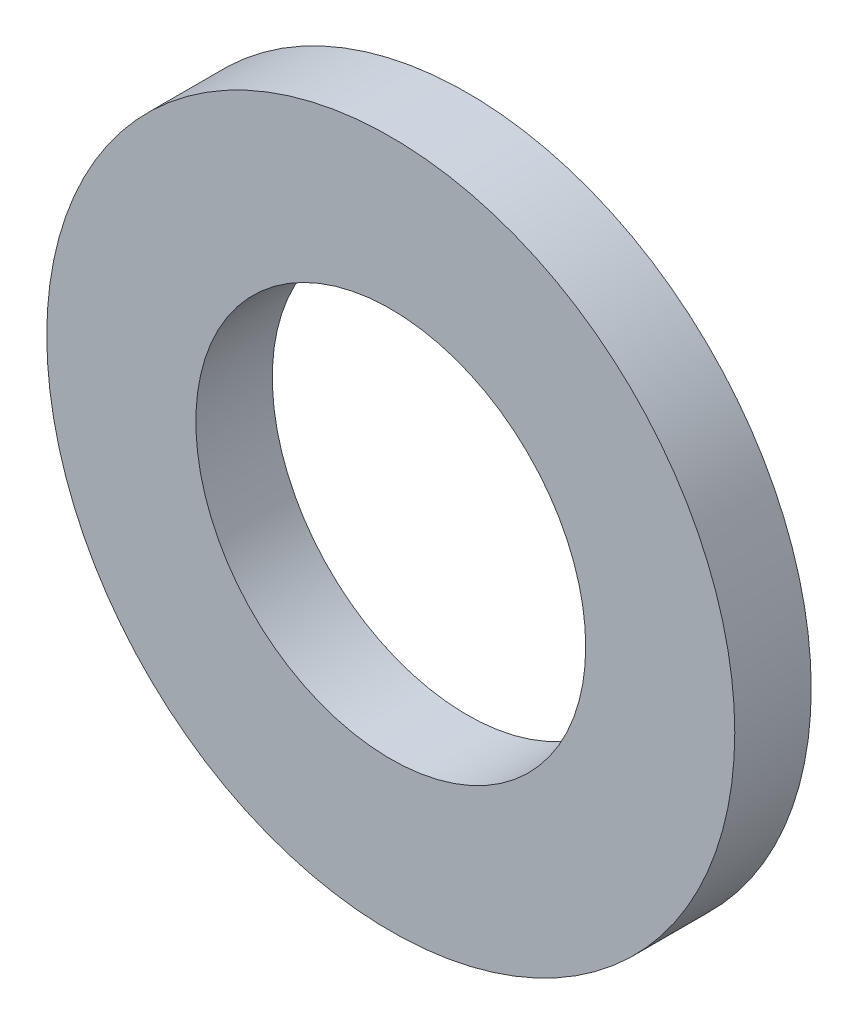
ISO-10303-21;
HEADER;
FILE_DESCRIPTION(('STEP AP214'),'2;1');
FILE_NAME('part.step','',(''),(''),'','','');
FILE_SCHEMA(('AUTOMOTIVE_DESIGN { 1 0 10303 214 1 1 1 1 }'));
ENDSEC;
DATA;
#1=APPLICATION_CONTEXT('core data for automotive mechanical design processes');
#2=APPLICATION_PROTOCOL_DEFINITION('international standard','automotive_design',2000,#1);
#3=PRODUCT_CONTEXT('',#1,'mechanical');
#4=PRODUCT('Part','Part','',(#3));
#5=PRODUCT_RELATED_PRODUCT_CATEGORY('part','',(#4));
#6=PRODUCT_DEFINITION_FORMATION('','',#4);
#7=PRODUCT_DEFINITION_CONTEXT('part definition',#1,'design');
#8=PRODUCT_DEFINITION('design','',#6,#7);
#9=PRODUCT_DEFINITION_SHAPE('','',#8);
#10=(LENGTH_UNIT() NAMED_UNIT(*) SI_UNIT(.MILLI.,.METRE.));
#11=(NAMED_UNIT(*) PLANE_ANGLE_UNIT() SI_UNIT($,.RADIAN.));
#12=(NAMED_UNIT(*) SI_UNIT($,.STERADIAN.) SOLID_ANGLE_UNIT());
#13=UNCERTAINTY_MEASURE_WITH_UNIT(LENGTH_MEASURE(1.E-05),#10,'distance_accuracy_value','');
#14=(GEOMETRIC_REPRESENTATION_CONTEXT(3) GLOBAL_UNCERTAINTY_ASSIGNED_CONTEXT((#13)) GLOBAL_UNIT_ASSIGNED_CONTEXT((#10,
#11,#12)) REPRESENTATION_CONTEXT('',''));
#15=CARTESIAN_POINT('',(0.,0.,0.));
#16=DIRECTION('',(0.,0.,1.));
#17=DIRECTION('',(1.,0.,0.));
#18=AXIS2_PLACEMENT_3D('',#15,#16,#17);
#19=CARTESIAN_POINT('',(0.,0.,2.));
#20=DIRECTION('',(0.,0.,1.));
#21=DIRECTION('',(1.,0.,0.));
#22=AXIS2_PLACEMENT_3D('',#19,#20,#21);
#23=PLANE('',#22);
#24=CARTESIAN_POINT('',(0.,0.,2.));
#25=DIRECTION('',(0.,0.,1.));
#26=DIRECTION('',(1.,0.,0.));
#27=AXIS2_PLACEMENT_3D('',#24,#25,#26);
#28=CIRCLE('',#27,9.);
#29=CARTESIAN_POINT('',(9.,0.,2.));
#30=VERTEX_POINT('',#29);
#31=EDGE_CURVE('E10',#30,#30,#28,.T.);
#32=ORIENTED_EDGE('',*,*,#31,.T.);
#33=EDGE_LOOP('',(#32));
#34=FACE_BOUND('',#33,.T.);
#35=CARTESIAN_POINT('',(0.,0.,2.));
#36=DIRECTION('',(0.,0.,1.));
#37=DIRECTION('',(1.,0.,0.));
#38=AXIS2_PLACEMENT_3D('',#35,#36,#37);
#39=CIRCLE('',#38,5.1);
#40=CARTESIAN_POINT('',(5.1,0.,2.));
#41=VERTEX_POINT('',#40);
#42=EDGE_CURVE('E42',#41,#41,#39,.T.);
#43=ORIENTED_EDGE('',*,*,#42,.F.);
#44=EDGE_LOOP('',(#43));
#45=FACE_BOUND('',#44,.T.);
#46=ADVANCED_FACE('F31',(#34,#45),#23,.T.);
#47=CARTESIAN_POINT('',(0.,0.,0.));
#48=DIRECTION('',(0.,0.,1.));
#49=DIRECTION('',(1.,0.,0.));
#50=AXIS2_PLACEMENT_3D('',#47,#48,#49);
#51=PLANE('',#50);
#52=CARTESIAN_POINT('',(0.,0.,0.));
#53=DIRECTION('',(0.,0.,1.));
#54=DIRECTION('',(1.,0.,0.));
#55=AXIS2_PLACEMENT_3D('',#52,#53,#54);
#56=CIRCLE('',#55,9.);
#57=CARTESIAN_POINT('',(9.,0.,0.));
#58=VERTEX_POINT('',#57);
#59=EDGE_CURVE('E35',#58,#58,#56,.T.);
#60=ORIENTED_EDGE('',*,*,#59,.F.);
#61=EDGE_LOOP('',(#60));
#62=FACE_BOUND('',#61,.T.);
#63=CARTESIAN_POINT('',(0.,0.,0.));
#64=DIRECTION('',(0.,0.,1.));
#65=DIRECTION('',(1.,0.,0.));
#66=AXIS2_PLACEMENT_3D('',#63,#64,#65);
#67=CIRCLE('',#66,5.1);
#68=CARTESIAN_POINT('',(5.1,0.,0.));
#69=VERTEX_POINT('',#68);
#70=EDGE_CURVE('E44',#69,#69,#67,.T.);
#71=ORIENTED_EDGE('',*,*,#70,.T.);
#72=EDGE_LOOP('',(#71));
#73=FACE_BOUND('',#72,.T.);
#74=ADVANCED_FACE('F54',(#62,#73),#51,.F.);
#75=CARTESIAN_POINT('',(0.,0.,2.));
#76=DIRECTION('',(0.,0.,-1.));
#77=DIRECTION('',(-1.,0.,0.));
#78=AXIS2_PLACEMENT_3D('',#75,#76,#77);
#79=CYLINDRICAL_SURFACE('',#78,9.);
#80=ORIENTED_EDGE('',*,*,#31,.F.);
#81=EDGE_LOOP('',(#80));
#82=FACE_BOUND('',#81,.T.);
#83=ORIENTED_EDGE('',*,*,#59,.T.);
#84=EDGE_LOOP('',(#83));
#85=FACE_BOUND('',#84,.T.);
#86=ADVANCED_FACE('F33',(#82,#85),#79,.T.);
#87=CARTESIAN_POINT('',(0.,0.,2.));
#88=DIRECTION('',(0.,0.,-1.));
#89=DIRECTION('',(-1.,0.,0.));
#90=AXIS2_PLACEMENT_3D('',#87,#88,#89);
#91=CYLINDRICAL_SURFACE('',#90,5.1);
#92=ORIENTED_EDGE('',*,*,#42,.T.);
#93=EDGE_LOOP('',(#92));
#94=FACE_BOUND('',#93,.T.);
#95=ORIENTED_EDGE('',*,*,#70,.F.);
#96=EDGE_LOOP('',(#95));
#97=FACE_BOUND('',#96,.T.);
#98=ADVANCED_FACE('F50',(#94,#97),#91,.F.);
#99=CLOSED_SHELL('',(#46,#74,#86,#98));
#100=MANIFOLD_SOLID_BREP('B2',#99);
#101=ADVANCED_BREP_SHAPE_REPRESENTATION('',(#18,#100),#14);
#102=SHAPE_DEFINITION_REPRESENTATION(#9,#101);
ENDSEC;
END-ISO-10303-21;
